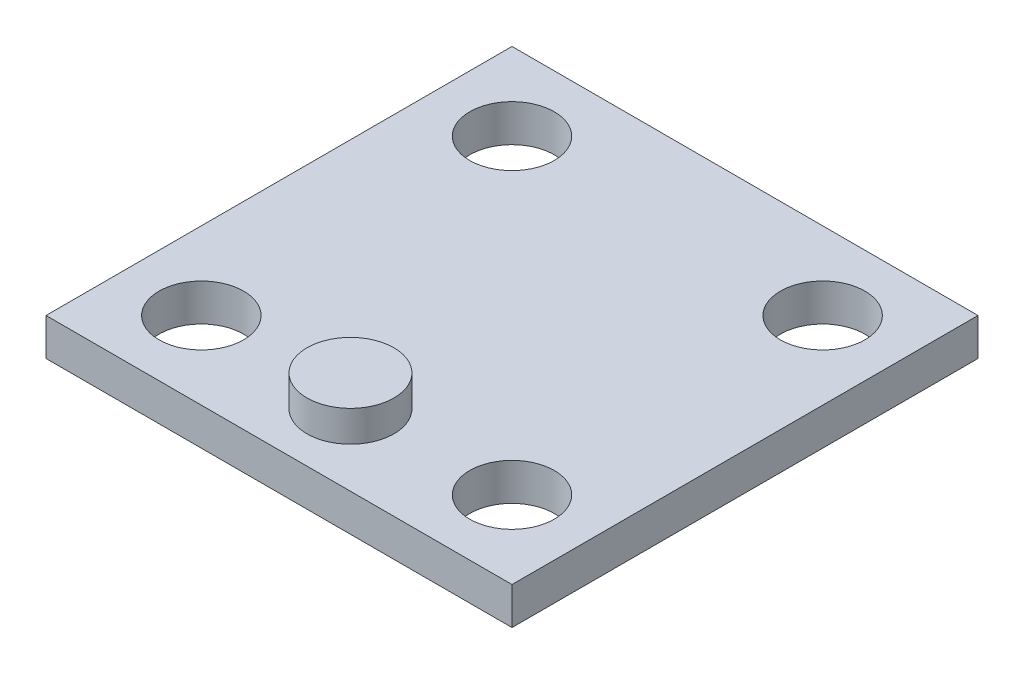
ISO-10303-21;
HEADER;
FILE_DESCRIPTION(('STEP AP214'),'2;1');
FILE_NAME('part.step','',(''),(''),'','','');
FILE_SCHEMA(('AUTOMOTIVE_DESIGN { 1 0 10303 214 1 1 1 1 }'));
ENDSEC;
DATA;
#1=APPLICATION_CONTEXT('core data for automotive mechanical design processes');
#2=APPLICATION_PROTOCOL_DEFINITION('international standard','automotive_design',2000,#1);
#3=PRODUCT_CONTEXT('',#1,'mechanical');
#4=PRODUCT('Part','Part','',(#3));
#5=PRODUCT_RELATED_PRODUCT_CATEGORY('part','',(#4));
#6=PRODUCT_DEFINITION_FORMATION('','',#4);
#7=PRODUCT_DEFINITION_CONTEXT('part definition',#1,'design');
#8=PRODUCT_DEFINITION('design','',#6,#7);
#9=PRODUCT_DEFINITION_SHAPE('','',#8);
#10=(LENGTH_UNIT() NAMED_UNIT(*) SI_UNIT(.MILLI.,.METRE.));
#11=(NAMED_UNIT(*) PLANE_ANGLE_UNIT() SI_UNIT($,.RADIAN.));
#12=(NAMED_UNIT(*) SI_UNIT($,.STERADIAN.) SOLID_ANGLE_UNIT());
#13=UNCERTAINTY_MEASURE_WITH_UNIT(LENGTH_MEASURE(1.E-05),#10,'distance_accuracy_value','');
#14=(GEOMETRIC_REPRESENTATION_CONTEXT(3) GLOBAL_UNCERTAINTY_ASSIGNED_CONTEXT((#13)) GLOBAL_UNIT_ASSIGNED_CONTEXT((#10,
#11,#12)) REPRESENTATION_CONTEXT('',''));
#15=CARTESIAN_POINT('',(0.,0.,0.));
#16=DIRECTION('',(0.,0.,1.));
#17=DIRECTION('',(1.,0.,0.));
#18=AXIS2_PLACEMENT_3D('',#15,#16,#17);
#19=CARTESIAN_POINT('',(9.525,2.794,-2.921));
#20=DIRECTION('',(0.,1.,0.));
#21=DIRECTION('',(0.,0.,1.));
#22=AXIS2_PLACEMENT_3D('',#19,#20,#21);
#23=PLANE('',#22);
#24=CARTESIAN_POINT('',(9.525,2.794,-2.921));
#25=DIRECTION('',(0.,-1.,0.));
#26=DIRECTION('',(0.,0.,-1.));
#27=AXIS2_PLACEMENT_3D('',#24,#25,#26);
#28=CIRCLE('',#27,1.778);
#29=CARTESIAN_POINT('',(9.525,2.794,-4.699));
#30=VERTEX_POINT('',#29);
#31=EDGE_CURVE('E20',#30,#30,#28,.T.);
#32=ORIENTED_EDGE('',*,*,#31,.F.);
#33=EDGE_LOOP('',(#32));
#34=FACE_BOUND('',#33,.T.);
#35=ADVANCED_FACE('F17',(#34),#23,.T.);
#36=CARTESIAN_POINT('',(9.525,2.794,-2.921));
#37=DIRECTION('',(0.,-1.,0.));
#38=DIRECTION('',(0.,0.,-1.));
#39=AXIS2_PLACEMENT_3D('',#36,#37,#38);
#40=CYLINDRICAL_SURFACE('',#39,1.778);
#41=ORIENTED_EDGE('',*,*,#31,.T.);
#42=EDGE_LOOP('',(#41));
#43=FACE_BOUND('',#42,.T.);
#44=CARTESIAN_POINT('',(9.525,1.524,-2.921));
#45=DIRECTION('',(0.,-1.,0.));
#46=DIRECTION('',(0.,0.,-1.));
#47=AXIS2_PLACEMENT_3D('',#44,#45,#46);
#48=CIRCLE('',#47,1.778);
#49=CARTESIAN_POINT('',(9.525,1.524,-4.699));
#50=VERTEX_POINT('',#49);
#51=EDGE_CURVE('E107',#50,#50,#48,.F.);
#52=ORIENTED_EDGE('',*,*,#51,.T.);
#53=EDGE_LOOP('',(#52));
#54=FACE_BOUND('',#53,.T.);
#55=ADVANCED_FACE('F114',(#43,#54),#40,.T.);
#56=CARTESIAN_POINT('',(0.,1.524,0.));
#57=DIRECTION('',(0.,-1.,0.));
#58=DIRECTION('',(0.,0.,-1.));
#59=AXIS2_PLACEMENT_3D('',#56,#57,#58);
#60=PLANE('',#59);
#61=ORIENTED_EDGE('',*,*,#51,.F.);
#62=EDGE_LOOP('',(#61));
#63=FACE_BOUND('',#62,.T.);
#64=CARTESIAN_POINT('',(3.175,1.524,-3.175));
#65=DIRECTION('',(0.,1.,0.));
#66=DIRECTION('',(0.,0.,1.));
#67=AXIS2_PLACEMENT_3D('',#64,#65,#66);
#68=CIRCLE('',#67,1.7272);
#69=CARTESIAN_POINT('',(3.175,1.524,-1.4478));
#70=VERTEX_POINT('',#69);
#71=EDGE_CURVE('E105',#70,#70,#68,.F.);
#72=ORIENTED_EDGE('',*,*,#71,.T.);
#73=EDGE_LOOP('',(#72));
#74=FACE_BOUND('',#73,.T.);
#75=CARTESIAN_POINT('',(3.175,1.524,-15.875));
#76=DIRECTION('',(0.,1.,0.));
#77=DIRECTION('',(0.,0.,1.));
#78=AXIS2_PLACEMENT_3D('',#75,#76,#77);
#79=CIRCLE('',#78,1.7272);
#80=CARTESIAN_POINT('',(3.175,1.524,-14.1478));
#81=VERTEX_POINT('',#80);
#82=EDGE_CURVE('E102',#81,#81,#79,.F.);
#83=ORIENTED_EDGE('',*,*,#82,.T.);
#84=EDGE_LOOP('',(#83));
#85=FACE_BOUND('',#84,.T.);
#86=CARTESIAN_POINT('',(15.875,1.524,-15.875));
#87=DIRECTION('',(0.,1.,0.));
#88=DIRECTION('',(0.,0.,1.));
#89=AXIS2_PLACEMENT_3D('',#86,#87,#88);
#90=CIRCLE('',#89,1.7272);
#91=CARTESIAN_POINT('',(15.875,1.524,-14.1478));
#92=VERTEX_POINT('',#91);
#93=EDGE_CURVE('E99',#92,#92,#90,.F.);
#94=ORIENTED_EDGE('',*,*,#93,.T.);
#95=EDGE_LOOP('',(#94));
#96=FACE_BOUND('',#95,.T.);
#97=CARTESIAN_POINT('',(15.875,1.524,-3.175));
#98=DIRECTION('',(0.,1.,0.));
#99=DIRECTION('',(0.,0.,1.));
#100=AXIS2_PLACEMENT_3D('',#97,#98,#99);
#101=CIRCLE('',#100,1.7272);
#102=CARTESIAN_POINT('',(15.875,1.524,-1.4478));
#103=VERTEX_POINT('',#102);
#104=EDGE_CURVE('E73',#103,#103,#101,.F.);
#105=ORIENTED_EDGE('',*,*,#104,.T.);
#106=EDGE_LOOP('',(#105));
#107=FACE_BOUND('',#106,.T.);
#108=DIRECTION('',(-1.,0.,0.));
#109=VECTOR('',#108,1.);
#110=CARTESIAN_POINT('',(0.,1.524,0.));
#111=LINE('',#110,#109);
#112=CARTESIAN_POINT('',(0.,1.524,0.));
#113=VERTEX_POINT('',#112);
#114=CARTESIAN_POINT('',(19.05,1.524,0.));
#115=VERTEX_POINT('',#114);
#116=EDGE_CURVE('E253',#113,#115,#111,.F.);
#117=ORIENTED_EDGE('',*,*,#116,.T.);
#118=DIRECTION('',(0.,0.,1.));
#119=VECTOR('',#118,1.);
#120=CARTESIAN_POINT('',(19.05,1.524,0.));
#121=LINE('',#120,#119);
#122=CARTESIAN_POINT('',(19.05,1.524,-19.05));
#123=VERTEX_POINT('',#122);
#124=EDGE_CURVE('E55',#115,#123,#121,.F.);
#125=ORIENTED_EDGE('',*,*,#124,.T.);
#126=DIRECTION('',(1.,0.,0.));
#127=VECTOR('',#126,1.);
#128=CARTESIAN_POINT('',(0.,1.524,-19.05));
#129=LINE('',#128,#127);
#130=CARTESIAN_POINT('',(0.,1.524,-19.05));
#131=VERTEX_POINT('',#130);
#132=EDGE_CURVE('E57',#123,#131,#129,.F.);
#133=ORIENTED_EDGE('',*,*,#132,.T.);
#134=DIRECTION('',(0.,0.,-1.));
#135=VECTOR('',#134,1.);
#136=CARTESIAN_POINT('',(0.,1.524,0.));
#137=LINE('',#136,#135);
#138=EDGE_CURVE('E60',#131,#113,#137,.F.);
#139=ORIENTED_EDGE('',*,*,#138,.T.);
#140=EDGE_LOOP('',(#117,#125,#133,#139));
#141=FACE_BOUND('',#140,.T.);
#142=ADVANCED_FACE('F59',(#63,#74,#85,#96,#107,#141),#60,.F.);
#143=CARTESIAN_POINT('',(3.175,0.,-3.175));
#144=DIRECTION('',(0.,1.,0.));
#145=DIRECTION('',(0.,0.,1.));
#146=AXIS2_PLACEMENT_3D('',#143,#144,#145);
#147=CYLINDRICAL_SURFACE('',#146,1.7272);
#148=ORIENTED_EDGE('',*,*,#71,.F.);
#149=EDGE_LOOP('',(#148));
#150=FACE_BOUND('',#149,.T.);
#151=CARTESIAN_POINT('',(3.175,0.,-3.175));
#152=DIRECTION('',(0.,1.,0.));
#153=DIRECTION('',(0.,0.,1.));
#154=AXIS2_PLACEMENT_3D('',#151,#152,#153);
#155=CIRCLE('',#154,1.7272);
#156=CARTESIAN_POINT('',(3.175,0.,-1.4478));
#157=VERTEX_POINT('',#156);
#158=EDGE_CURVE('E94',#157,#157,#155,.T.);
#159=ORIENTED_EDGE('',*,*,#158,.F.);
#160=EDGE_LOOP('',(#159));
#161=FACE_BOUND('',#160,.T.);
#162=ADVANCED_FACE('F152',(#150,#161),#147,.F.);
#163=CARTESIAN_POINT('',(3.175,0.,-15.875));
#164=DIRECTION('',(0.,1.,0.));
#165=DIRECTION('',(0.,0.,1.));
#166=AXIS2_PLACEMENT_3D('',#163,#164,#165);
#167=CYLINDRICAL_SURFACE('',#166,1.7272);
#168=ORIENTED_EDGE('',*,*,#82,.F.);
#169=EDGE_LOOP('',(#168));
#170=FACE_BOUND('',#169,.T.);
#171=CARTESIAN_POINT('',(3.175,0.,-15.875));
#172=DIRECTION('',(0.,1.,0.));
#173=DIRECTION('',(0.,0.,1.));
#174=AXIS2_PLACEMENT_3D('',#171,#172,#173);
#175=CIRCLE('',#174,1.7272);
#176=CARTESIAN_POINT('',(3.175,0.,-14.1478));
#177=VERTEX_POINT('',#176);
#178=EDGE_CURVE('E91',#177,#177,#175,.T.);
#179=ORIENTED_EDGE('',*,*,#178,.F.);
#180=EDGE_LOOP('',(#179));
#181=FACE_BOUND('',#180,.T.);
#182=ADVANCED_FACE('F148',(#170,#181),#167,.F.);
#183=CARTESIAN_POINT('',(15.875,0.,-15.875));
#184=DIRECTION('',(0.,1.,0.));
#185=DIRECTION('',(0.,0.,1.));
#186=AXIS2_PLACEMENT_3D('',#183,#184,#185);
#187=CYLINDRICAL_SURFACE('',#186,1.7272);
#188=ORIENTED_EDGE('',*,*,#93,.F.);
#189=EDGE_LOOP('',(#188));
#190=FACE_BOUND('',#189,.T.);
#191=CARTESIAN_POINT('',(15.875,0.,-15.875));
#192=DIRECTION('',(0.,1.,0.));
#193=DIRECTION('',(0.,0.,1.));
#194=AXIS2_PLACEMENT_3D('',#191,#192,#193);
#195=CIRCLE('',#194,1.7272);
#196=CARTESIAN_POINT('',(15.875,0.,-14.1478));
#197=VERTEX_POINT('',#196);
#198=EDGE_CURVE('E88',#197,#197,#195,.T.);
#199=ORIENTED_EDGE('',*,*,#198,.F.);
#200=EDGE_LOOP('',(#199));
#201=FACE_BOUND('',#200,.T.);
#202=ADVANCED_FACE('F144',(#190,#201),#187,.F.);
#203=CARTESIAN_POINT('',(15.875,0.,-3.175));
#204=DIRECTION('',(0.,1.,0.));
#205=DIRECTION('',(0.,0.,1.));
#206=AXIS2_PLACEMENT_3D('',#203,#204,#205);
#207=CYLINDRICAL_SURFACE('',#206,1.7272);
#208=ORIENTED_EDGE('',*,*,#104,.F.);
#209=EDGE_LOOP('',(#208));
#210=FACE_BOUND('',#209,.T.);
#211=CARTESIAN_POINT('',(15.875,0.,-3.175));
#212=DIRECTION('',(0.,1.,0.));
#213=DIRECTION('',(0.,0.,1.));
#214=AXIS2_PLACEMENT_3D('',#211,#212,#213);
#215=CIRCLE('',#214,1.7272);
#216=CARTESIAN_POINT('',(15.875,0.,-1.4478));
#217=VERTEX_POINT('',#216);
#218=EDGE_CURVE('E84',#217,#217,#215,.T.);
#219=ORIENTED_EDGE('',*,*,#218,.F.);
#220=EDGE_LOOP('',(#219));
#221=FACE_BOUND('',#220,.T.);
#222=ADVANCED_FACE('F141',(#210,#221),#207,.F.);
#223=CARTESIAN_POINT('',(0.,1.524,0.));
#224=DIRECTION('',(1.,0.,0.));
#225=DIRECTION('',(0.,0.,-1.));
#226=AXIS2_PLACEMENT_3D('',#223,#224,#225);
#227=PLANE('',#226);
#228=DIRECTION('',(0.,1.,0.));
#229=VECTOR('',#228,1.);
#230=CARTESIAN_POINT('',(0.,1.524,0.));
#231=LINE('',#230,#229);
#232=CARTESIAN_POINT('',(0.,0.,0.));
#233=VERTEX_POINT('',#232);
#234=EDGE_CURVE('E71',#233,#113,#231,.T.);
#235=ORIENTED_EDGE('',*,*,#234,.T.);
#236=ORIENTED_EDGE('',*,*,#138,.F.);
#237=DIRECTION('',(0.,1.,0.));
#238=VECTOR('',#237,1.);
#239=CARTESIAN_POINT('',(0.,1.524,-19.05));
#240=LINE('',#239,#238);
#241=CARTESIAN_POINT('',(0.,0.,-19.05));
#242=VERTEX_POINT('',#241);
#243=EDGE_CURVE('E65',#131,#242,#240,.F.);
#244=ORIENTED_EDGE('',*,*,#243,.T.);
#245=DIRECTION('',(0.,0.,-1.));
#246=VECTOR('',#245,1.);
#247=CARTESIAN_POINT('',(0.,0.,0.));
#248=LINE('',#247,#246);
#249=EDGE_CURVE('E87',#233,#242,#248,.T.);
#250=ORIENTED_EDGE('',*,*,#249,.F.);
#251=EDGE_LOOP('',(#235,#236,#244,#250));
#252=FACE_BOUND('',#251,.T.);
#253=ADVANCED_FACE('F68',(#252),#227,.F.);
#254=CARTESIAN_POINT('',(0.,1.524,-19.05));
#255=DIRECTION('',(0.,0.,1.));
#256=DIRECTION('',(1.,0.,0.));
#257=AXIS2_PLACEMENT_3D('',#254,#255,#256);
#258=PLANE('',#257);
#259=ORIENTED_EDGE('',*,*,#243,.F.);
#260=ORIENTED_EDGE('',*,*,#132,.F.);
#261=DIRECTION('',(0.,1.,0.));
#262=VECTOR('',#261,1.);
#263=CARTESIAN_POINT('',(19.05,1.524,-19.05));
#264=LINE('',#263,#262);
#265=CARTESIAN_POINT('',(19.05,0.,-19.05));
#266=VERTEX_POINT('',#265);
#267=EDGE_CURVE('E80',#123,#266,#264,.F.);
#268=ORIENTED_EDGE('',*,*,#267,.T.);
#269=DIRECTION('',(1.,0.,0.));
#270=VECTOR('',#269,1.);
#271=CARTESIAN_POINT('',(0.,0.,-19.05));
#272=LINE('',#271,#270);
#273=EDGE_CURVE('E77',#242,#266,#272,.T.);
#274=ORIENTED_EDGE('',*,*,#273,.F.);
#275=EDGE_LOOP('',(#259,#260,#268,#274));
#276=FACE_BOUND('',#275,.T.);
#277=ADVANCED_FACE('F75',(#276),#258,.F.);
#278=CARTESIAN_POINT('',(19.05,1.524,0.));
#279=DIRECTION('',(-1.,0.,0.));
#280=DIRECTION('',(0.,0.,1.));
#281=AXIS2_PLACEMENT_3D('',#278,#279,#280);
#282=PLANE('',#281);
#283=ORIENTED_EDGE('',*,*,#267,.F.);
#284=ORIENTED_EDGE('',*,*,#124,.F.);
#285=DIRECTION('',(0.,1.,0.));
#286=VECTOR('',#285,1.);
#287=CARTESIAN_POINT('',(19.05,1.524,0.));
#288=LINE('',#287,#286);
#289=CARTESIAN_POINT('',(19.05,0.,0.));
#290=VERTEX_POINT('',#289);
#291=EDGE_CURVE('E35',#115,#290,#288,.F.);
#292=ORIENTED_EDGE('',*,*,#291,.T.);
#293=DIRECTION('',(0.,0.,-1.));
#294=VECTOR('',#293,1.);
#295=CARTESIAN_POINT('',(19.05,0.,0.));
#296=LINE('',#295,#294);
#297=EDGE_CURVE('E26',#266,#290,#296,.F.);
#298=ORIENTED_EDGE('',*,*,#297,.F.);
#299=EDGE_LOOP('',(#283,#284,#292,#298));
#300=FACE_BOUND('',#299,.T.);
#301=ADVANCED_FACE('F129',(#300),#282,.F.);
#302=CARTESIAN_POINT('',(0.,1.524,0.));
#303=DIRECTION('',(0.,0.,-1.));
#304=DIRECTION('',(-1.,0.,0.));
#305=AXIS2_PLACEMENT_3D('',#302,#303,#304);
#306=PLANE('',#305);
#307=ORIENTED_EDGE('',*,*,#291,.F.);
#308=ORIENTED_EDGE('',*,*,#116,.F.);
#309=ORIENTED_EDGE('',*,*,#234,.F.);
#310=DIRECTION('',(1.,0.,0.));
#311=VECTOR('',#310,1.);
#312=CARTESIAN_POINT('',(0.,0.,0.));
#313=LINE('',#312,#311);
#314=EDGE_CURVE('E11',#290,#233,#313,.F.);
#315=ORIENTED_EDGE('',*,*,#314,.F.);
#316=EDGE_LOOP('',(#307,#308,#309,#315));
#317=FACE_BOUND('',#316,.T.);
#318=ADVANCED_FACE('F123',(#317),#306,.F.);
#319=CARTESIAN_POINT('',(0.,0.,0.));
#320=DIRECTION('',(0.,-1.,0.));
#321=DIRECTION('',(0.,0.,-1.));
#322=AXIS2_PLACEMENT_3D('',#319,#320,#321);
#323=PLANE('',#322);
#324=ORIENTED_EDGE('',*,*,#297,.T.);
#325=ORIENTED_EDGE('',*,*,#314,.T.);
#326=ORIENTED_EDGE('',*,*,#249,.T.);
#327=ORIENTED_EDGE('',*,*,#273,.T.);
#328=EDGE_LOOP('',(#324,#325,#326,#327));
#329=FACE_BOUND('',#328,.T.);
#330=ORIENTED_EDGE('',*,*,#218,.T.);
#331=EDGE_LOOP('',(#330));
#332=FACE_BOUND('',#331,.T.);
#333=ORIENTED_EDGE('',*,*,#198,.T.);
#334=EDGE_LOOP('',(#333));
#335=FACE_BOUND('',#334,.T.);
#336=ORIENTED_EDGE('',*,*,#178,.T.);
#337=EDGE_LOOP('',(#336));
#338=FACE_BOUND('',#337,.T.);
#339=ORIENTED_EDGE('',*,*,#158,.T.);
#340=EDGE_LOOP('',(#339));
#341=FACE_BOUND('',#340,.T.);
#342=ADVANCED_FACE('F121',(#329,#332,#335,#338,#341),#323,.T.);
#343=CLOSED_SHELL('',(#35,#55,#142,#162,#182,#202,#222,#253,#277,#301,#318,#342));
#344=MANIFOLD_SOLID_BREP('B1',#343);
#345=ADVANCED_BREP_SHAPE_REPRESENTATION('',(#18,#344),#14);
#346=SHAPE_DEFINITION_REPRESENTATION(#9,#345);
ENDSEC;
END-ISO-10303-21;
